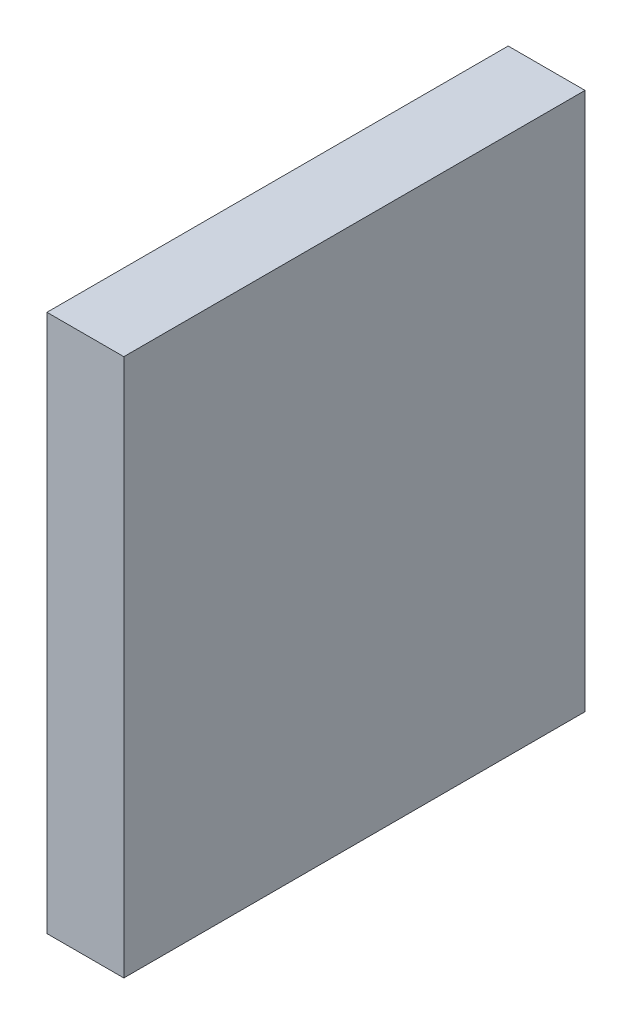
ISO-10303-21;
HEADER;
FILE_DESCRIPTION(('STEP AP214'),'2;1');
FILE_NAME('part.step','',(''),(''),'','','');
FILE_SCHEMA(('AUTOMOTIVE_DESIGN { 1 0 10303 214 1 1 1 1 }'));
ENDSEC;
DATA;
#1=APPLICATION_CONTEXT('core data for automotive mechanical design processes');
#2=APPLICATION_PROTOCOL_DEFINITION('international standard','automotive_design',2000,#1);
#3=PRODUCT_CONTEXT('',#1,'mechanical');
#4=PRODUCT('Part','Part','',(#3));
#5=PRODUCT_RELATED_PRODUCT_CATEGORY('part','',(#4));
#6=PRODUCT_DEFINITION_FORMATION('','',#4);
#7=PRODUCT_DEFINITION_CONTEXT('part definition',#1,'design');
#8=PRODUCT_DEFINITION('design','',#6,#7);
#9=PRODUCT_DEFINITION_SHAPE('','',#8);
#10=(LENGTH_UNIT() NAMED_UNIT(*) SI_UNIT(.MILLI.,.METRE.));
#11=(NAMED_UNIT(*) PLANE_ANGLE_UNIT() SI_UNIT($,.RADIAN.));
#12=(NAMED_UNIT(*) SI_UNIT($,.STERADIAN.) SOLID_ANGLE_UNIT());
#13=UNCERTAINTY_MEASURE_WITH_UNIT(LENGTH_MEASURE(1.E-05),#10,'distance_accuracy_value','');
#14=(GEOMETRIC_REPRESENTATION_CONTEXT(3) GLOBAL_UNCERTAINTY_ASSIGNED_CONTEXT((#13)) GLOBAL_UNIT_ASSIGNED_CONTEXT((#10,
#11,#12)) REPRESENTATION_CONTEXT('',''));
#15=CARTESIAN_POINT('',(0.,0.,0.));
#16=DIRECTION('',(0.,0.,1.));
#17=DIRECTION('',(1.,0.,0.));
#18=AXIS2_PLACEMENT_3D('',#15,#16,#17);
#19=CARTESIAN_POINT('',(25.5,1.87,13.36));
#20=DIRECTION('',(1.,0.,0.));
#21=DIRECTION('',(0.,0.,-1.));
#22=AXIS2_PLACEMENT_3D('',#19,#20,#21);
#23=PLANE('',#22);
#24=DIRECTION('',(0.,0.,1.));
#25=VECTOR('',#24,1.);
#26=CARTESIAN_POINT('',(25.5,2.22,13.06));
#27=LINE('',#26,#25);
#28=CARTESIAN_POINT('',(25.5,2.22,13.06));
#29=VERTEX_POINT('',#28);
#30=CARTESIAN_POINT('',(25.5,2.22,13.66));
#31=VERTEX_POINT('',#30);
#32=EDGE_CURVE('E79',#29,#31,#27,.T.);
#33=ORIENTED_EDGE('',*,*,#32,.F.);
#34=DIRECTION('',(0.,1.,0.));
#35=VECTOR('',#34,1.);
#36=CARTESIAN_POINT('',(25.5,1.52,13.06));
#37=LINE('',#36,#35);
#38=CARTESIAN_POINT('',(25.5,1.52,13.06));
#39=VERTEX_POINT('',#38);
#40=EDGE_CURVE('E55',#39,#29,#37,.T.);
#41=ORIENTED_EDGE('',*,*,#40,.F.);
#42=DIRECTION('',(0.,0.,-1.));
#43=VECTOR('',#42,1.);
#44=CARTESIAN_POINT('',(25.5,1.52,13.66));
#45=LINE('',#44,#43);
#46=CARTESIAN_POINT('',(25.5,1.52,13.66));
#47=VERTEX_POINT('',#46);
#48=EDGE_CURVE('E57',#47,#39,#45,.T.);
#49=ORIENTED_EDGE('',*,*,#48,.F.);
#50=DIRECTION('',(0.,1.,0.));
#51=VECTOR('',#50,1.);
#52=CARTESIAN_POINT('',(25.5,2.22,13.66));
#53=LINE('',#52,#51);
#54=EDGE_CURVE('E20',#31,#47,#53,.F.);
#55=ORIENTED_EDGE('',*,*,#54,.F.);
#56=EDGE_LOOP('',(#33,#41,#49,#55));
#57=FACE_BOUND('',#56,.T.);
#58=ADVANCED_FACE('F17',(#57),#23,.F.);
#59=CARTESIAN_POINT('',(25.5,2.22,13.66));
#60=DIRECTION('',(0.,0.,1.));
#61=DIRECTION('',(1.,0.,0.));
#62=AXIS2_PLACEMENT_3D('',#59,#60,#61);
#63=PLANE('',#62);
#64=DIRECTION('',(0.,1.,0.));
#65=VECTOR('',#64,1.);
#66=CARTESIAN_POINT('',(25.6,1.87,13.66));
#67=LINE('',#66,#65);
#68=CARTESIAN_POINT('',(25.6,2.22,13.66));
#69=VERTEX_POINT('',#68);
#70=CARTESIAN_POINT('',(25.6,1.52,13.66));
#71=VERTEX_POINT('',#70);
#72=EDGE_CURVE('E83',#69,#71,#67,.F.);
#73=ORIENTED_EDGE('',*,*,#72,.F.);
#74=DIRECTION('',(1.,0.,0.));
#75=VECTOR('',#74,1.);
#76=CARTESIAN_POINT('',(25.5,2.22,13.66));
#77=LINE('',#76,#75);
#78=EDGE_CURVE('E68',#31,#69,#77,.T.);
#79=ORIENTED_EDGE('',*,*,#78,.F.);
#80=ORIENTED_EDGE('',*,*,#54,.T.);
#81=DIRECTION('',(1.,0.,0.));
#82=VECTOR('',#81,1.);
#83=CARTESIAN_POINT('',(25.5,1.52,13.66));
#84=LINE('',#83,#82);
#85=EDGE_CURVE('E63',#71,#47,#84,.F.);
#86=ORIENTED_EDGE('',*,*,#85,.F.);
#87=EDGE_LOOP('',(#73,#79,#80,#86));
#88=FACE_BOUND('',#87,.T.);
#89=ADVANCED_FACE('F65',(#88),#63,.T.);
#90=CARTESIAN_POINT('',(25.5,1.52,13.66));
#91=DIRECTION('',(0.,-1.,0.));
#92=DIRECTION('',(0.,0.,-1.));
#93=AXIS2_PLACEMENT_3D('',#90,#91,#92);
#94=PLANE('',#93);
#95=DIRECTION('',(0.,0.,-1.));
#96=VECTOR('',#95,1.);
#97=CARTESIAN_POINT('',(25.6,1.52,13.36));
#98=LINE('',#97,#96);
#99=CARTESIAN_POINT('',(25.6,1.52,13.06));
#100=VERTEX_POINT('',#99);
#101=EDGE_CURVE('E72',#71,#100,#98,.T.);
#102=ORIENTED_EDGE('',*,*,#101,.F.);
#103=ORIENTED_EDGE('',*,*,#85,.T.);
#104=ORIENTED_EDGE('',*,*,#48,.T.);
#105=DIRECTION('',(-1.,0.,0.));
#106=VECTOR('',#105,1.);
#107=CARTESIAN_POINT('',(25.5,1.52,13.06));
#108=LINE('',#107,#106);
#109=EDGE_CURVE('E75',#100,#39,#108,.T.);
#110=ORIENTED_EDGE('',*,*,#109,.F.);
#111=EDGE_LOOP('',(#102,#103,#104,#110));
#112=FACE_BOUND('',#111,.T.);
#113=ADVANCED_FACE('F70',(#112),#94,.T.);
#114=CARTESIAN_POINT('',(25.5,1.52,13.06));
#115=DIRECTION('',(0.,0.,-1.));
#116=DIRECTION('',(-1.,0.,0.));
#117=AXIS2_PLACEMENT_3D('',#114,#115,#116);
#118=PLANE('',#117);
#119=DIRECTION('',(0.,1.,0.));
#120=VECTOR('',#119,1.);
#121=CARTESIAN_POINT('',(25.6,1.87,13.06));
#122=LINE('',#121,#120);
#123=CARTESIAN_POINT('',(25.6,2.22,13.06));
#124=VERTEX_POINT('',#123);
#125=EDGE_CURVE('E26',#100,#124,#122,.T.);
#126=ORIENTED_EDGE('',*,*,#125,.F.);
#127=ORIENTED_EDGE('',*,*,#109,.T.);
#128=ORIENTED_EDGE('',*,*,#40,.T.);
#129=DIRECTION('',(1.,0.,0.));
#130=VECTOR('',#129,1.);
#131=CARTESIAN_POINT('',(25.5,2.22,13.06));
#132=LINE('',#131,#130);
#133=EDGE_CURVE('E35',#124,#29,#132,.F.);
#134=ORIENTED_EDGE('',*,*,#133,.F.);
#135=EDGE_LOOP('',(#126,#127,#128,#134));
#136=FACE_BOUND('',#135,.T.);
#137=ADVANCED_FACE('F89',(#136),#118,.T.);
#138=CARTESIAN_POINT('',(25.5,2.22,13.06));
#139=DIRECTION('',(0.,1.,0.));
#140=DIRECTION('',(0.,0.,1.));
#141=AXIS2_PLACEMENT_3D('',#138,#139,#140);
#142=PLANE('',#141);
#143=DIRECTION('',(0.,0.,-1.));
#144=VECTOR('',#143,1.);
#145=CARTESIAN_POINT('',(25.6,2.22,13.36));
#146=LINE('',#145,#144);
#147=EDGE_CURVE('E11',#124,#69,#146,.F.);
#148=ORIENTED_EDGE('',*,*,#147,.F.);
#149=ORIENTED_EDGE('',*,*,#133,.T.);
#150=ORIENTED_EDGE('',*,*,#32,.T.);
#151=ORIENTED_EDGE('',*,*,#78,.T.);
#152=EDGE_LOOP('',(#148,#149,#150,#151));
#153=FACE_BOUND('',#152,.T.);
#154=ADVANCED_FACE('F91',(#153),#142,.T.);
#155=CARTESIAN_POINT('',(25.6,1.87,13.36));
#156=DIRECTION('',(1.,0.,0.));
#157=DIRECTION('',(0.,0.,-1.));
#158=AXIS2_PLACEMENT_3D('',#155,#156,#157);
#159=PLANE('',#158);
#160=ORIENTED_EDGE('',*,*,#125,.T.);
#161=ORIENTED_EDGE('',*,*,#147,.T.);
#162=ORIENTED_EDGE('',*,*,#72,.T.);
#163=ORIENTED_EDGE('',*,*,#101,.T.);
#164=EDGE_LOOP('',(#160,#161,#162,#163));
#165=FACE_BOUND('',#164,.T.);
#166=ADVANCED_FACE('F88',(#165),#159,.T.);
#167=CLOSED_SHELL('',(#58,#89,#113,#137,#154,#166));
#168=MANIFOLD_SOLID_BREP('B1',#167);
#169=ADVANCED_BREP_SHAPE_REPRESENTATION('',(#18,#168),#14);
#170=SHAPE_DEFINITION_REPRESENTATION(#9,#169);
ENDSEC;
END-ISO-10303-21;
